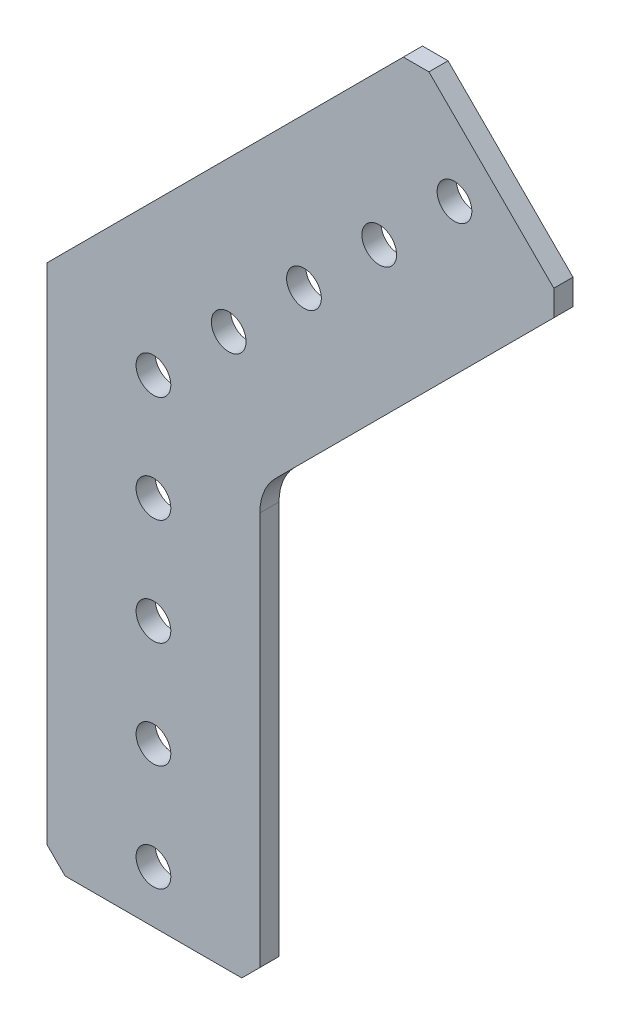
ISO-10303-21;
HEADER;
FILE_DESCRIPTION(('STEP AP214'),'2;1');
FILE_NAME('part.step','',(''),(''),'','','');
FILE_SCHEMA(('AUTOMOTIVE_DESIGN { 1 0 10303 214 1 1 1 1 }'));
ENDSEC;
DATA;
#1=APPLICATION_CONTEXT('core data for automotive mechanical design processes');
#2=APPLICATION_PROTOCOL_DEFINITION('international standard','automotive_design',2000,#1);
#3=PRODUCT_CONTEXT('',#1,'mechanical');
#4=PRODUCT('Part','Part','',(#3));
#5=PRODUCT_RELATED_PRODUCT_CATEGORY('part','',(#4));
#6=PRODUCT_DEFINITION_FORMATION('','',#4);
#7=PRODUCT_DEFINITION_CONTEXT('part definition',#1,'design');
#8=PRODUCT_DEFINITION('design','',#6,#7);
#9=PRODUCT_DEFINITION_SHAPE('','',#8);
#10=(LENGTH_UNIT() NAMED_UNIT(*) SI_UNIT(.MILLI.,.METRE.));
#11=(NAMED_UNIT(*) PLANE_ANGLE_UNIT() SI_UNIT($,.RADIAN.));
#12=(NAMED_UNIT(*) SI_UNIT($,.STERADIAN.) SOLID_ANGLE_UNIT());
#13=UNCERTAINTY_MEASURE_WITH_UNIT(LENGTH_MEASURE(1.E-05),#10,'distance_accuracy_value','');
#14=(GEOMETRIC_REPRESENTATION_CONTEXT(3) GLOBAL_UNCERTAINTY_ASSIGNED_CONTEXT((#13)) GLOBAL_UNIT_ASSIGNED_CONTEXT((#10,
#11,#12)) REPRESENTATION_CONTEXT('',''));
#15=CARTESIAN_POINT('',(0.,0.,0.));
#16=DIRECTION('',(0.,0.,1.));
#17=DIRECTION('',(1.,0.,0.));
#18=AXIS2_PLACEMENT_3D('',#15,#16,#17);
#19=CARTESIAN_POINT('',(0.,0.,2.286));
#20=DIRECTION('',(0.,0.,1.));
#21=DIRECTION('',(1.,0.,0.));
#22=AXIS2_PLACEMENT_3D('',#19,#20,#21);
#23=PLANE('',#22);
#24=CARTESIAN_POINT('',(35.9210244842766,35.9210244842766,2.286));
#25=DIRECTION('',(0.,0.,-1.));
#26=DIRECTION('',(-1.,0.,0.));
#27=AXIS2_PLACEMENT_3D('',#24,#25,#26);
#28=CIRCLE('',#27,2.0701);
#29=CARTESIAN_POINT('',(33.8509244842766,35.9210244842766,2.286));
#30=VERTEX_POINT('',#29);
#31=EDGE_CURVE('E204',#30,#30,#28,.T.);
#32=ORIENTED_EDGE('',*,*,#31,.T.);
#33=EDGE_LOOP('',(#32));
#34=FACE_BOUND('',#33,.T.);
#35=CARTESIAN_POINT('',(17.9605122421385,17.9605122421381,2.286));
#36=DIRECTION('',(0.,0.,-1.));
#37=DIRECTION('',(-1.,0.,0.));
#38=AXIS2_PLACEMENT_3D('',#35,#36,#37);
#39=CIRCLE('',#38,2.0701);
#40=CARTESIAN_POINT('',(15.8904122421385,17.9605122421381,2.286));
#41=VERTEX_POINT('',#40);
#42=EDGE_CURVE('E207',#41,#41,#39,.T.);
#43=ORIENTED_EDGE('',*,*,#42,.T.);
#44=EDGE_LOOP('',(#43));
#45=FACE_BOUND('',#44,.T.);
#46=CARTESIAN_POINT('',(8.98025612106925,8.98025612106906,2.286));
#47=DIRECTION('',(0.,0.,-1.));
#48=DIRECTION('',(-1.,0.,0.));
#49=AXIS2_PLACEMENT_3D('',#46,#47,#48);
#50=CIRCLE('',#49,2.0701);
#51=CARTESIAN_POINT('',(6.91015612106925,8.98025612106906,2.286));
#52=VERTEX_POINT('',#51);
#53=EDGE_CURVE('E210',#52,#52,#50,.T.);
#54=ORIENTED_EDGE('',*,*,#53,.T.);
#55=EDGE_LOOP('',(#54));
#56=FACE_BOUND('',#55,.T.);
#57=CARTESIAN_POINT('',(26.9407683632077,26.9407683632072,2.286));
#58=DIRECTION('',(0.,0.,-1.));
#59=DIRECTION('',(-1.,0.,0.));
#60=AXIS2_PLACEMENT_3D('',#57,#58,#59);
#61=CIRCLE('',#60,2.0701);
#62=CARTESIAN_POINT('',(24.8706683632077,26.9407683632072,2.286));
#63=VERTEX_POINT('',#62);
#64=EDGE_CURVE('E213',#63,#63,#61,.T.);
#65=ORIENTED_EDGE('',*,*,#64,.T.);
#66=EDGE_LOOP('',(#65));
#67=FACE_BOUND('',#66,.T.);
#68=CARTESIAN_POINT('',(0.,-50.8,2.286));
#69=DIRECTION('',(0.,0.,-1.));
#70=DIRECTION('',(-1.,0.,0.));
#71=AXIS2_PLACEMENT_3D('',#68,#69,#70);
#72=CIRCLE('',#71,2.0701);
#73=CARTESIAN_POINT('',(-2.07009999999999,-50.8,2.286));
#74=VERTEX_POINT('',#73);
#75=EDGE_CURVE('E216',#74,#74,#72,.T.);
#76=ORIENTED_EDGE('',*,*,#75,.T.);
#77=EDGE_LOOP('',(#76));
#78=FACE_BOUND('',#77,.T.);
#79=CARTESIAN_POINT('',(2.66050878019847E-13,-25.4,2.286));
#80=DIRECTION('',(0.,0.,-1.));
#81=DIRECTION('',(-1.,0.,0.));
#82=AXIS2_PLACEMENT_3D('',#79,#80,#81);
#83=CIRCLE('',#82,2.0701);
#84=CARTESIAN_POINT('',(-2.07009999999973,-25.4,2.286));
#85=VERTEX_POINT('',#84);
#86=EDGE_CURVE('E171',#85,#85,#83,.T.);
#87=ORIENTED_EDGE('',*,*,#86,.T.);
#88=EDGE_LOOP('',(#87));
#89=FACE_BOUND('',#88,.T.);
#90=DIRECTION('',(1.,0.,0.));
#91=VECTOR('',#90,1.);
#92=CARTESIAN_POINT('',(29.8144503219496,47.7749625640879,2.286));
#93=LINE('',#92,#91);
#94=CARTESIAN_POINT('',(32.8677374031131,47.7749625640879,2.286));
#95=VERTEX_POINT('',#94);
#96=CARTESIAN_POINT('',(29.8144503219496,47.7749625640879,2.286));
#97=VERTEX_POINT('',#96);
#98=EDGE_CURVE('E525',#95,#97,#93,.F.);
#99=ORIENTED_EDGE('',*,*,#98,.T.);
#100=DIRECTION('',(0.707106781186547,0.707106781186548,0.));
#101=VECTOR('',#100,1.);
#102=CARTESIAN_POINT('',(31.3410938625313,49.3016061046697,2.286));
#103=LINE('',#102,#101);
#104=CARTESIAN_POINT('',(-12.7,5.26051224213831,2.286));
#105=VERTEX_POINT('',#104);
#106=EDGE_CURVE('E520',#97,#105,#103,.F.);
#107=ORIENTED_EDGE('',*,*,#106,.T.);
#108=DIRECTION('',(0.,1.,0.));
#109=VECTOR('',#108,1.);
#110=CARTESIAN_POINT('',(-12.7,-57.023,2.286));
#111=LINE('',#110,#109);
#112=CARTESIAN_POINT('',(-12.7,-54.864,2.286));
#113=VERTEX_POINT('',#112);
#114=EDGE_CURVE('E517',#105,#113,#111,.F.);
#115=ORIENTED_EDGE('',*,*,#114,.T.);
#116=DIRECTION('',(-0.707106781186548,0.707106781186548,0.));
#117=VECTOR('',#116,1.);
#118=CARTESIAN_POINT('',(-10.541,-57.023,2.286));
#119=LINE('',#118,#117);
#120=CARTESIAN_POINT('',(-10.541,-57.023,2.286));
#121=VERTEX_POINT('',#120);
#122=EDGE_CURVE('E155',#113,#121,#119,.F.);
#123=ORIENTED_EDGE('',*,*,#122,.T.);
#124=DIRECTION('',(1.,0.,0.));
#125=VECTOR('',#124,1.);
#126=CARTESIAN_POINT('',(12.7,-57.023,2.286));
#127=LINE('',#126,#125);
#128=CARTESIAN_POINT('',(10.541,-57.023,2.286));
#129=VERTEX_POINT('',#128);
#130=EDGE_CURVE('E168',#121,#129,#127,.T.);
#131=ORIENTED_EDGE('',*,*,#130,.T.);
#132=DIRECTION('',(-0.707106781186547,-0.707106781186548,0.));
#133=VECTOR('',#132,1.);
#134=CARTESIAN_POINT('',(12.7,-54.864,2.286));
#135=LINE('',#134,#133);
#136=CARTESIAN_POINT('',(12.7,-54.864,2.286));
#137=VERTEX_POINT('',#136);
#138=EDGE_CURVE('E142',#129,#137,#135,.F.);
#139=ORIENTED_EDGE('',*,*,#138,.T.);
#140=DIRECTION('',(0.,-1.,0.));
#141=VECTOR('',#140,1.);
#142=CARTESIAN_POINT('',(12.7,-5.2605122421383,2.286));
#143=LINE('',#142,#141);
#144=CARTESIAN_POINT('',(12.7,-7.89076836320745,2.286));
#145=VERTEX_POINT('',#144);
#146=EDGE_CURVE('E98',#137,#145,#143,.F.);
#147=ORIENTED_EDGE('',*,*,#146,.T.);
#148=CARTESIAN_POINT('',(19.05,-7.89076836320745,2.286));
#149=DIRECTION('',(0.,0.,1.));
#150=DIRECTION('',(1.,0.,0.));
#151=AXIS2_PLACEMENT_3D('',#148,#149,#150);
#152=CIRCLE('',#151,6.35);
#153=CARTESIAN_POINT('',(14.5598719394654,-3.40064030267288,2.286));
#154=VERTEX_POINT('',#153);
#155=EDGE_CURVE('E100',#145,#154,#152,.F.);
#156=ORIENTED_EDGE('',*,*,#155,.T.);
#157=DIRECTION('',(-0.707106781186547,-0.707106781186548,0.));
#158=VECTOR('',#157,1.);
#159=CARTESIAN_POINT('',(12.7,-5.26051224213831,2.286));
#160=LINE('',#159,#158);
#161=CARTESIAN_POINT('',(47.7749625640879,29.8144503219496,2.286));
#162=VERTEX_POINT('',#161);
#163=EDGE_CURVE('E103',#154,#162,#160,.F.);
#164=ORIENTED_EDGE('',*,*,#163,.T.);
#165=DIRECTION('',(0.,-1.,0.));
#166=VECTOR('',#165,1.);
#167=CARTESIAN_POINT('',(47.7749625640879,32.8677374031131,2.286));
#168=LINE('',#167,#166);
#169=CARTESIAN_POINT('',(47.7749625640879,32.8677374031131,2.286));
#170=VERTEX_POINT('',#169);
#171=EDGE_CURVE('E135',#162,#170,#168,.F.);
#172=ORIENTED_EDGE('',*,*,#171,.T.);
#173=DIRECTION('',(0.707106781186548,-0.707106781186547,0.));
#174=VECTOR('',#173,1.);
#175=CARTESIAN_POINT('',(49.3016061046696,31.3410938625314,2.286));
#176=LINE('',#175,#174);
#177=EDGE_CURVE('E529',#170,#95,#176,.F.);
#178=ORIENTED_EDGE('',*,*,#177,.T.);
#179=EDGE_LOOP('',(#99,#107,#115,#123,#131,#139,#147,#156,#164,#172,#178));
#180=FACE_BOUND('',#179,.T.);
#181=CARTESIAN_POINT('',(1.33025439009923E-13,-12.7,2.286));
#182=DIRECTION('',(0.,0.,-1.));
#183=DIRECTION('',(-1.,0.,0.));
#184=AXIS2_PLACEMENT_3D('',#181,#182,#183);
#185=CIRCLE('',#184,2.0701);
#186=CARTESIAN_POINT('',(-2.07009999999987,-12.7,2.286));
#187=VERTEX_POINT('',#186);
#188=EDGE_CURVE('E165',#187,#187,#185,.T.);
#189=ORIENTED_EDGE('',*,*,#188,.T.);
#190=EDGE_LOOP('',(#189));
#191=FACE_BOUND('',#190,.T.);
#192=CARTESIAN_POINT('',(3.9907631702977E-13,-38.1,2.286));
#193=DIRECTION('',(0.,0.,-1.));
#194=DIRECTION('',(-1.,0.,0.));
#195=AXIS2_PLACEMENT_3D('',#192,#193,#194);
#196=CIRCLE('',#195,2.0701);
#197=CARTESIAN_POINT('',(-2.0700999999996,-38.1,2.286));
#198=VERTEX_POINT('',#197);
#199=EDGE_CURVE('E222',#198,#198,#196,.T.);
#200=ORIENTED_EDGE('',*,*,#199,.T.);
#201=EDGE_LOOP('',(#200));
#202=FACE_BOUND('',#201,.T.);
#203=CARTESIAN_POINT('',(0.,0.,2.286));
#204=DIRECTION('',(0.,0.,-1.));
#205=DIRECTION('',(-1.,0.,0.));
#206=AXIS2_PLACEMENT_3D('',#203,#204,#205);
#207=CIRCLE('',#206,2.0701);
#208=CARTESIAN_POINT('',(-2.0701,0.,2.286));
#209=VERTEX_POINT('',#208);
#210=EDGE_CURVE('E20',#209,#209,#207,.T.);
#211=ORIENTED_EDGE('',*,*,#210,.T.);
#212=EDGE_LOOP('',(#211));
#213=FACE_BOUND('',#212,.T.);
#214=ADVANCED_FACE('F17',(#34,#45,#56,#67,#78,#89,#180,#191,#202,#213),#23,.T.);
#215=CARTESIAN_POINT('',(0.,0.,2.286));
#216=DIRECTION('',(0.,0.,-1.));
#217=DIRECTION('',(-1.,0.,0.));
#218=AXIS2_PLACEMENT_3D('',#215,#216,#217);
#219=CYLINDRICAL_SURFACE('',#218,2.0701);
#220=ORIENTED_EDGE('',*,*,#210,.F.);
#221=EDGE_LOOP('',(#220));
#222=FACE_BOUND('',#221,.T.);
#223=CARTESIAN_POINT('',(0.,0.,0.));
#224=DIRECTION('',(0.,0.,-1.));
#225=DIRECTION('',(-1.,0.,0.));
#226=AXIS2_PLACEMENT_3D('',#223,#224,#225);
#227=CIRCLE('',#226,2.0701);
#228=CARTESIAN_POINT('',(-2.0701,0.,0.));
#229=VERTEX_POINT('',#228);
#230=EDGE_CURVE('E201',#229,#229,#227,.T.);
#231=ORIENTED_EDGE('',*,*,#230,.T.);
#232=EDGE_LOOP('',(#231));
#233=FACE_BOUND('',#232,.T.);
#234=ADVANCED_FACE('F230',(#222,#233),#219,.F.);
#235=CARTESIAN_POINT('',(3.9907631702977E-13,-38.1,2.286));
#236=DIRECTION('',(0.,0.,-1.));
#237=DIRECTION('',(-1.,0.,0.));
#238=AXIS2_PLACEMENT_3D('',#235,#236,#237);
#239=CYLINDRICAL_SURFACE('',#238,2.0701);
#240=CARTESIAN_POINT('',(3.9907631702977E-13,-38.1,0.));
#241=DIRECTION('',(0.,0.,-1.));
#242=DIRECTION('',(-1.,0.,0.));
#243=AXIS2_PLACEMENT_3D('',#240,#241,#242);
#244=CIRCLE('',#243,2.0701);
#245=CARTESIAN_POINT('',(-2.0700999999996,-38.1,0.));
#246=VERTEX_POINT('',#245);
#247=EDGE_CURVE('E198',#246,#246,#244,.T.);
#248=ORIENTED_EDGE('',*,*,#247,.T.);
#249=EDGE_LOOP('',(#248));
#250=FACE_BOUND('',#249,.T.);
#251=ORIENTED_EDGE('',*,*,#199,.F.);
#252=EDGE_LOOP('',(#251));
#253=FACE_BOUND('',#252,.T.);
#254=ADVANCED_FACE('F233',(#250,#253),#239,.F.);
#255=CARTESIAN_POINT('',(1.33025439009923E-13,-12.7,2.286));
#256=DIRECTION('',(0.,0.,-1.));
#257=DIRECTION('',(-1.,0.,0.));
#258=AXIS2_PLACEMENT_3D('',#255,#256,#257);
#259=CYLINDRICAL_SURFACE('',#258,2.0701);
#260=CARTESIAN_POINT('',(1.33025439009923E-13,-12.7,0.));
#261=DIRECTION('',(0.,0.,-1.));
#262=DIRECTION('',(-1.,0.,0.));
#263=AXIS2_PLACEMENT_3D('',#260,#261,#262);
#264=CIRCLE('',#263,2.0701);
#265=CARTESIAN_POINT('',(-2.07009999999987,-12.7,0.));
#266=VERTEX_POINT('',#265);
#267=EDGE_CURVE('E149',#266,#266,#264,.T.);
#268=ORIENTED_EDGE('',*,*,#267,.T.);
#269=EDGE_LOOP('',(#268));
#270=FACE_BOUND('',#269,.T.);
#271=ORIENTED_EDGE('',*,*,#188,.F.);
#272=EDGE_LOOP('',(#271));
#273=FACE_BOUND('',#272,.T.);
#274=ADVANCED_FACE('F308',(#270,#273),#259,.F.);
#275=CARTESIAN_POINT('',(12.7,-54.864,2.286));
#276=DIRECTION('',(-0.707106781186548,0.707106781186547,0.));
#277=DIRECTION('',(-0.707106781186547,-0.707106781186548,0.));
#278=AXIS2_PLACEMENT_3D('',#275,#276,#277);
#279=PLANE('',#278);
#280=DIRECTION('',(0.,0.,1.));
#281=VECTOR('',#280,1.);
#282=CARTESIAN_POINT('',(10.541,-57.023,2.286));
#283=LINE('',#282,#281);
#284=CARTESIAN_POINT('',(10.541,-57.023,0.));
#285=VERTEX_POINT('',#284);
#286=EDGE_CURVE('E152',#129,#285,#283,.F.);
#287=ORIENTED_EDGE('',*,*,#286,.T.);
#288=DIRECTION('',(0.707106781186548,0.707106781186547,0.));
#289=VECTOR('',#288,1.);
#290=CARTESIAN_POINT('',(10.541,-57.023,0.));
#291=LINE('',#290,#289);
#292=CARTESIAN_POINT('',(12.7,-54.864,0.));
#293=VERTEX_POINT('',#292);
#294=EDGE_CURVE('E145',#285,#293,#291,.T.);
#295=ORIENTED_EDGE('',*,*,#294,.T.);
#296=DIRECTION('',(0.,0.,1.));
#297=VECTOR('',#296,1.);
#298=CARTESIAN_POINT('',(12.7,-54.864,2.286));
#299=LINE('',#298,#297);
#300=EDGE_CURVE('E139',#293,#137,#299,.T.);
#301=ORIENTED_EDGE('',*,*,#300,.T.);
#302=ORIENTED_EDGE('',*,*,#138,.F.);
#303=EDGE_LOOP('',(#287,#295,#301,#302));
#304=FACE_BOUND('',#303,.T.);
#305=ADVANCED_FACE('F304',(#304),#279,.F.);
#306=CARTESIAN_POINT('',(12.7,-5.2605122421383,2.286));
#307=DIRECTION('',(-1.,0.,0.));
#308=DIRECTION('',(0.,-1.,0.));
#309=AXIS2_PLACEMENT_3D('',#306,#307,#308);
#310=PLANE('',#309);
#311=DIRECTION('',(0.,0.,1.));
#312=VECTOR('',#311,1.);
#313=CARTESIAN_POINT('',(12.7,-7.89076836320745,2.286));
#314=LINE('',#313,#312);
#315=CARTESIAN_POINT('',(12.7,-7.89076836320745,0.));
#316=VERTEX_POINT('',#315);
#317=EDGE_CURVE('E109',#316,#145,#314,.T.);
#318=ORIENTED_EDGE('',*,*,#317,.T.);
#319=ORIENTED_EDGE('',*,*,#146,.F.);
#320=ORIENTED_EDGE('',*,*,#300,.F.);
#321=DIRECTION('',(0.,1.,0.));
#322=VECTOR('',#321,1.);
#323=CARTESIAN_POINT('',(12.7,0.,0.));
#324=LINE('',#323,#322);
#325=EDGE_CURVE('E148',#293,#316,#324,.T.);
#326=ORIENTED_EDGE('',*,*,#325,.T.);
#327=EDGE_LOOP('',(#318,#319,#320,#326));
#328=FACE_BOUND('',#327,.T.);
#329=ADVANCED_FACE('F301',(#328),#310,.F.);
#330=CARTESIAN_POINT('',(19.05,-7.89076836320745,2.286));
#331=DIRECTION('',(0.,0.,1.));
#332=DIRECTION('',(1.,0.,0.));
#333=AXIS2_PLACEMENT_3D('',#330,#331,#332);
#334=CYLINDRICAL_SURFACE('',#333,6.35);
#335=ORIENTED_EDGE('',*,*,#317,.F.);
#336=CARTESIAN_POINT('',(19.05,-7.89076836320745,0.));
#337=DIRECTION('',(0.,0.,1.));
#338=DIRECTION('',(1.,0.,0.));
#339=AXIS2_PLACEMENT_3D('',#336,#337,#338);
#340=CIRCLE('',#339,6.35);
#341=CARTESIAN_POINT('',(14.5598719394654,-3.40064030267288,0.));
#342=VERTEX_POINT('',#341);
#343=EDGE_CURVE('E121',#316,#342,#340,.F.);
#344=ORIENTED_EDGE('',*,*,#343,.T.);
#345=DIRECTION('',(0.,0.,1.));
#346=VECTOR('',#345,1.);
#347=CARTESIAN_POINT('',(14.5598719394654,-3.40064030267288,2.286));
#348=LINE('',#347,#346);
#349=EDGE_CURVE('E108',#342,#154,#348,.T.);
#350=ORIENTED_EDGE('',*,*,#349,.T.);
#351=ORIENTED_EDGE('',*,*,#155,.F.);
#352=EDGE_LOOP('',(#335,#344,#350,#351));
#353=FACE_BOUND('',#352,.T.);
#354=ADVANCED_FACE('F119',(#353),#334,.F.);
#355=CARTESIAN_POINT('',(12.7,-5.26051224213831,2.286));
#356=DIRECTION('',(-0.707106781186548,0.707106781186547,0.));
#357=DIRECTION('',(-0.707106781186547,-0.707106781186548,0.));
#358=AXIS2_PLACEMENT_3D('',#355,#356,#357);
#359=PLANE('',#358);
#360=ORIENTED_EDGE('',*,*,#349,.F.);
#361=DIRECTION('',(0.707106781186547,0.707106781186548,0.));
#362=VECTOR('',#361,1.);
#363=CARTESIAN_POINT('',(14.5598719394654,-3.40064030267288,0.));
#364=LINE('',#363,#362);
#365=CARTESIAN_POINT('',(47.7749625640879,29.8144503219496,0.));
#366=VERTEX_POINT('',#365);
#367=EDGE_CURVE('E131',#342,#366,#364,.T.);
#368=ORIENTED_EDGE('',*,*,#367,.T.);
#369=DIRECTION('',(0.,0.,1.));
#370=VECTOR('',#369,1.);
#371=CARTESIAN_POINT('',(47.7749625640879,29.8144503219496,2.286));
#372=LINE('',#371,#370);
#373=EDGE_CURVE('E116',#366,#162,#372,.T.);
#374=ORIENTED_EDGE('',*,*,#373,.T.);
#375=ORIENTED_EDGE('',*,*,#163,.F.);
#376=EDGE_LOOP('',(#360,#368,#374,#375));
#377=FACE_BOUND('',#376,.T.);
#378=ADVANCED_FACE('F113',(#377),#359,.F.);
#379=CARTESIAN_POINT('',(47.7749625640879,32.8677374031131,2.286));
#380=DIRECTION('',(-1.,0.,0.));
#381=DIRECTION('',(0.,-1.,0.));
#382=AXIS2_PLACEMENT_3D('',#379,#380,#381);
#383=PLANE('',#382);
#384=ORIENTED_EDGE('',*,*,#373,.F.);
#385=DIRECTION('',(0.,1.,0.));
#386=VECTOR('',#385,1.);
#387=CARTESIAN_POINT('',(47.7749625640879,0.,0.));
#388=LINE('',#387,#386);
#389=CARTESIAN_POINT('',(47.7749625640879,32.8677374031131,0.));
#390=VERTEX_POINT('',#389);
#391=EDGE_CURVE('E127',#366,#390,#388,.T.);
#392=ORIENTED_EDGE('',*,*,#391,.T.);
#393=DIRECTION('',(0.,0.,1.));
#394=VECTOR('',#393,1.);
#395=CARTESIAN_POINT('',(47.7749625640879,32.8677374031131,2.286));
#396=LINE('',#395,#394);
#397=EDGE_CURVE('E125',#390,#170,#396,.T.);
#398=ORIENTED_EDGE('',*,*,#397,.T.);
#399=ORIENTED_EDGE('',*,*,#171,.F.);
#400=EDGE_LOOP('',(#384,#392,#398,#399));
#401=FACE_BOUND('',#400,.T.);
#402=ADVANCED_FACE('F292',(#401),#383,.F.);
#403=CARTESIAN_POINT('',(49.3016061046696,31.3410938625314,2.286));
#404=DIRECTION('',(-0.707106781186547,-0.707106781186548,0.));
#405=DIRECTION('',(0.707106781186548,-0.707106781186547,0.));
#406=AXIS2_PLACEMENT_3D('',#403,#404,#405);
#407=PLANE('',#406);
#408=DIRECTION('',(0.,0.,-1.));
#409=VECTOR('',#408,1.);
#410=CARTESIAN_POINT('',(32.8677374031131,47.7749625640879,2.286));
#411=LINE('',#410,#409);
#412=CARTESIAN_POINT('',(32.8677374031131,47.7749625640879,0.));
#413=VERTEX_POINT('',#412);
#414=EDGE_CURVE('E527',#413,#95,#411,.F.);
#415=ORIENTED_EDGE('',*,*,#414,.T.);
#416=ORIENTED_EDGE('',*,*,#177,.F.);
#417=ORIENTED_EDGE('',*,*,#397,.F.);
#418=DIRECTION('',(-0.707106781186547,0.707106781186547,0.));
#419=VECTOR('',#418,1.);
#420=CARTESIAN_POINT('',(47.7749625640879,32.8677374031131,0.));
#421=LINE('',#420,#419);
#422=EDGE_CURVE('E130',#390,#413,#421,.T.);
#423=ORIENTED_EDGE('',*,*,#422,.T.);
#424=EDGE_LOOP('',(#415,#416,#417,#423));
#425=FACE_BOUND('',#424,.T.);
#426=ADVANCED_FACE('F288',(#425),#407,.F.);
#427=CARTESIAN_POINT('',(29.8144503219496,47.7749625640879,2.286));
#428=DIRECTION('',(0.,-1.,0.));
#429=DIRECTION('',(0.,0.,-1.));
#430=AXIS2_PLACEMENT_3D('',#427,#428,#429);
#431=PLANE('',#430);
#432=ORIENTED_EDGE('',*,*,#414,.F.);
#433=DIRECTION('',(1.,0.,0.));
#434=VECTOR('',#433,1.);
#435=CARTESIAN_POINT('',(0.,47.7749625640879,0.));
#436=LINE('',#435,#434);
#437=CARTESIAN_POINT('',(29.8144503219496,47.7749625640879,0.));
#438=VERTEX_POINT('',#437);
#439=EDGE_CURVE('E500',#413,#438,#436,.F.);
#440=ORIENTED_EDGE('',*,*,#439,.T.);
#441=DIRECTION('',(0.,0.,1.));
#442=VECTOR('',#441,1.);
#443=CARTESIAN_POINT('',(29.8144503219496,47.7749625640879,2.286));
#444=LINE('',#443,#442);
#445=EDGE_CURVE('E522',#438,#97,#444,.T.);
#446=ORIENTED_EDGE('',*,*,#445,.T.);
#447=ORIENTED_EDGE('',*,*,#98,.F.);
#448=EDGE_LOOP('',(#432,#440,#446,#447));
#449=FACE_BOUND('',#448,.T.);
#450=ADVANCED_FACE('F284',(#449),#431,.F.);
#451=CARTESIAN_POINT('',(31.3410938625313,49.3016061046697,2.286));
#452=DIRECTION('',(0.707106781186548,-0.707106781186547,0.));
#453=DIRECTION('',(0.707106781186547,0.707106781186548,0.));
#454=AXIS2_PLACEMENT_3D('',#451,#452,#453);
#455=PLANE('',#454);
#456=ORIENTED_EDGE('',*,*,#445,.F.);
#457=DIRECTION('',(-0.707106781186547,-0.707106781186548,0.));
#458=VECTOR('',#457,1.);
#459=CARTESIAN_POINT('',(29.8144503219496,47.7749625640879,0.));
#460=LINE('',#459,#458);
#461=CARTESIAN_POINT('',(-12.7,5.26051224213831,0.));
#462=VERTEX_POINT('',#461);
#463=EDGE_CURVE('E498',#438,#462,#460,.T.);
#464=ORIENTED_EDGE('',*,*,#463,.T.);
#465=DIRECTION('',(0.,0.,1.));
#466=VECTOR('',#465,1.);
#467=CARTESIAN_POINT('',(-12.7,5.2605122421383,2.286));
#468=LINE('',#467,#466);
#469=EDGE_CURVE('E497',#462,#105,#468,.T.);
#470=ORIENTED_EDGE('',*,*,#469,.T.);
#471=ORIENTED_EDGE('',*,*,#106,.F.);
#472=EDGE_LOOP('',(#456,#464,#470,#471));
#473=FACE_BOUND('',#472,.T.);
#474=ADVANCED_FACE('F280',(#473),#455,.F.);
#475=CARTESIAN_POINT('',(-12.7,-57.023,2.286));
#476=DIRECTION('',(1.,0.,0.));
#477=DIRECTION('',(0.,1.,0.));
#478=AXIS2_PLACEMENT_3D('',#475,#476,#477);
#479=PLANE('',#478);
#480=DIRECTION('',(0.,0.,1.));
#481=VECTOR('',#480,1.);
#482=CARTESIAN_POINT('',(-12.7,-54.864,2.286));
#483=LINE('',#482,#481);
#484=CARTESIAN_POINT('',(-12.7,-54.864,0.));
#485=VERTEX_POINT('',#484);
#486=EDGE_CURVE('E495',#485,#113,#483,.T.);
#487=ORIENTED_EDGE('',*,*,#486,.T.);
#488=ORIENTED_EDGE('',*,*,#114,.F.);
#489=ORIENTED_EDGE('',*,*,#469,.F.);
#490=DIRECTION('',(0.,1.,0.));
#491=VECTOR('',#490,1.);
#492=CARTESIAN_POINT('',(-12.7,0.,0.));
#493=LINE('',#492,#491);
#494=EDGE_CURVE('E490',#462,#485,#493,.F.);
#495=ORIENTED_EDGE('',*,*,#494,.T.);
#496=EDGE_LOOP('',(#487,#488,#489,#495));
#497=FACE_BOUND('',#496,.T.);
#498=ADVANCED_FACE('F276',(#497),#479,.F.);
#499=CARTESIAN_POINT('',(-10.541,-57.023,2.286));
#500=DIRECTION('',(0.707106781186548,0.707106781186548,0.));
#501=DIRECTION('',(-0.707106781186548,0.707106781186548,0.));
#502=AXIS2_PLACEMENT_3D('',#499,#500,#501);
#503=PLANE('',#502);
#504=ORIENTED_EDGE('',*,*,#486,.F.);
#505=DIRECTION('',(0.707106781186547,-0.707106781186548,0.));
#506=VECTOR('',#505,1.);
#507=CARTESIAN_POINT('',(-12.7,-54.864,0.));
#508=LINE('',#507,#506);
#509=CARTESIAN_POINT('',(-10.541,-57.023,0.));
#510=VERTEX_POINT('',#509);
#511=EDGE_CURVE('E161',#485,#510,#508,.T.);
#512=ORIENTED_EDGE('',*,*,#511,.T.);
#513=DIRECTION('',(0.,0.,1.));
#514=VECTOR('',#513,1.);
#515=CARTESIAN_POINT('',(-10.541,-57.023,2.286));
#516=LINE('',#515,#514);
#517=EDGE_CURVE('E35',#510,#121,#516,.T.);
#518=ORIENTED_EDGE('',*,*,#517,.T.);
#519=ORIENTED_EDGE('',*,*,#122,.F.);
#520=EDGE_LOOP('',(#504,#512,#518,#519));
#521=FACE_BOUND('',#520,.T.);
#522=ADVANCED_FACE('F273',(#521),#503,.F.);
#523=CARTESIAN_POINT('',(12.7,-57.023,2.286));
#524=DIRECTION('',(0.,1.,0.));
#525=DIRECTION('',(0.,0.,1.));
#526=AXIS2_PLACEMENT_3D('',#523,#524,#525);
#527=PLANE('',#526);
#528=ORIENTED_EDGE('',*,*,#517,.F.);
#529=DIRECTION('',(1.,0.,0.));
#530=VECTOR('',#529,1.);
#531=CARTESIAN_POINT('',(0.,-57.023,0.));
#532=LINE('',#531,#530);
#533=EDGE_CURVE('E158',#510,#285,#532,.T.);
#534=ORIENTED_EDGE('',*,*,#533,.T.);
#535=ORIENTED_EDGE('',*,*,#286,.F.);
#536=ORIENTED_EDGE('',*,*,#130,.F.);
#537=EDGE_LOOP('',(#528,#534,#535,#536));
#538=FACE_BOUND('',#537,.T.);
#539=ADVANCED_FACE('F269',(#538),#527,.F.);
#540=CARTESIAN_POINT('',(2.66050878019847E-13,-25.4,2.286));
#541=DIRECTION('',(0.,0.,-1.));
#542=DIRECTION('',(-1.,0.,0.));
#543=AXIS2_PLACEMENT_3D('',#540,#541,#542);
#544=CYLINDRICAL_SURFACE('',#543,2.0701);
#545=CARTESIAN_POINT('',(2.66050878019847E-13,-25.4,0.));
#546=DIRECTION('',(0.,0.,-1.));
#547=DIRECTION('',(-1.,0.,0.));
#548=AXIS2_PLACEMENT_3D('',#545,#546,#547);
#549=CIRCLE('',#548,2.0701);
#550=CARTESIAN_POINT('',(-2.07009999999973,-25.4,0.));
#551=VERTEX_POINT('',#550);
#552=EDGE_CURVE('E160',#551,#551,#549,.T.);
#553=ORIENTED_EDGE('',*,*,#552,.T.);
#554=EDGE_LOOP('',(#553));
#555=FACE_BOUND('',#554,.T.);
#556=ORIENTED_EDGE('',*,*,#86,.F.);
#557=EDGE_LOOP('',(#556));
#558=FACE_BOUND('',#557,.T.);
#559=ADVANCED_FACE('F265',(#555,#558),#544,.F.);
#560=CARTESIAN_POINT('',(0.,-50.8,2.286));
#561=DIRECTION('',(0.,0.,-1.));
#562=DIRECTION('',(-1.,0.,0.));
#563=AXIS2_PLACEMENT_3D('',#560,#561,#562);
#564=CYLINDRICAL_SURFACE('',#563,2.0701);
#565=CARTESIAN_POINT('',(0.,-50.8,0.));
#566=DIRECTION('',(0.,0.,-1.));
#567=DIRECTION('',(-1.,0.,0.));
#568=AXIS2_PLACEMENT_3D('',#565,#566,#567);
#569=CIRCLE('',#568,2.0701);
#570=CARTESIAN_POINT('',(-2.07009999999999,-50.8,0.));
#571=VERTEX_POINT('',#570);
#572=EDGE_CURVE('E190',#571,#571,#569,.T.);
#573=ORIENTED_EDGE('',*,*,#572,.T.);
#574=EDGE_LOOP('',(#573));
#575=FACE_BOUND('',#574,.T.);
#576=ORIENTED_EDGE('',*,*,#75,.F.);
#577=EDGE_LOOP('',(#576));
#578=FACE_BOUND('',#577,.T.);
#579=ADVANCED_FACE('F261',(#575,#578),#564,.F.);
#580=CARTESIAN_POINT('',(26.9407683632077,26.9407683632072,2.286));
#581=DIRECTION('',(0.,0.,-1.));
#582=DIRECTION('',(-1.,0.,0.));
#583=AXIS2_PLACEMENT_3D('',#580,#581,#582);
#584=CYLINDRICAL_SURFACE('',#583,2.0701);
#585=ORIENTED_EDGE('',*,*,#64,.F.);
#586=EDGE_LOOP('',(#585));
#587=FACE_BOUND('',#586,.T.);
#588=CARTESIAN_POINT('',(26.9407683632077,26.9407683632072,0.));
#589=DIRECTION('',(0.,0.,-1.));
#590=DIRECTION('',(-1.,0.,0.));
#591=AXIS2_PLACEMENT_3D('',#588,#589,#590);
#592=CIRCLE('',#591,2.0701);
#593=CARTESIAN_POINT('',(24.8706683632077,26.9407683632072,0.));
#594=VERTEX_POINT('',#593);
#595=EDGE_CURVE('E187',#594,#594,#592,.T.);
#596=ORIENTED_EDGE('',*,*,#595,.T.);
#597=EDGE_LOOP('',(#596));
#598=FACE_BOUND('',#597,.T.);
#599=ADVANCED_FACE('F257',(#587,#598),#584,.F.);
#600=CARTESIAN_POINT('',(8.98025612106925,8.98025612106906,2.286));
#601=DIRECTION('',(0.,0.,-1.));
#602=DIRECTION('',(-1.,0.,0.));
#603=AXIS2_PLACEMENT_3D('',#600,#601,#602);
#604=CYLINDRICAL_SURFACE('',#603,2.0701);
#605=ORIENTED_EDGE('',*,*,#53,.F.);
#606=EDGE_LOOP('',(#605));
#607=FACE_BOUND('',#606,.T.);
#608=CARTESIAN_POINT('',(8.98025612106925,8.98025612106906,0.));
#609=DIRECTION('',(0.,0.,-1.));
#610=DIRECTION('',(-1.,0.,0.));
#611=AXIS2_PLACEMENT_3D('',#608,#609,#610);
#612=CIRCLE('',#611,2.0701);
#613=CARTESIAN_POINT('',(6.91015612106925,8.98025612106906,0.));
#614=VERTEX_POINT('',#613);
#615=EDGE_CURVE('E184',#614,#614,#612,.T.);
#616=ORIENTED_EDGE('',*,*,#615,.T.);
#617=EDGE_LOOP('',(#616));
#618=FACE_BOUND('',#617,.T.);
#619=ADVANCED_FACE('F253',(#607,#618),#604,.F.);
#620=CARTESIAN_POINT('',(17.9605122421385,17.9605122421381,2.286));
#621=DIRECTION('',(0.,0.,-1.));
#622=DIRECTION('',(-1.,0.,0.));
#623=AXIS2_PLACEMENT_3D('',#620,#621,#622);
#624=CYLINDRICAL_SURFACE('',#623,2.0701);
#625=ORIENTED_EDGE('',*,*,#42,.F.);
#626=EDGE_LOOP('',(#625));
#627=FACE_BOUND('',#626,.T.);
#628=CARTESIAN_POINT('',(17.9605122421385,17.9605122421381,0.));
#629=DIRECTION('',(0.,0.,-1.));
#630=DIRECTION('',(-1.,0.,0.));
#631=AXIS2_PLACEMENT_3D('',#628,#629,#630);
#632=CIRCLE('',#631,2.0701);
#633=CARTESIAN_POINT('',(15.8904122421385,17.9605122421381,0.));
#634=VERTEX_POINT('',#633);
#635=EDGE_CURVE('E26',#634,#634,#632,.T.);
#636=ORIENTED_EDGE('',*,*,#635,.T.);
#637=EDGE_LOOP('',(#636));
#638=FACE_BOUND('',#637,.T.);
#639=ADVANCED_FACE('F245',(#627,#638),#624,.F.);
#640=CARTESIAN_POINT('',(35.9210244842766,35.9210244842766,2.286));
#641=DIRECTION('',(0.,0.,-1.));
#642=DIRECTION('',(-1.,0.,0.));
#643=AXIS2_PLACEMENT_3D('',#640,#641,#642);
#644=CYLINDRICAL_SURFACE('',#643,2.0701);
#645=ORIENTED_EDGE('',*,*,#31,.F.);
#646=EDGE_LOOP('',(#645));
#647=FACE_BOUND('',#646,.T.);
#648=CARTESIAN_POINT('',(35.9210244842766,35.9210244842766,0.));
#649=DIRECTION('',(0.,0.,-1.));
#650=DIRECTION('',(-1.,0.,0.));
#651=AXIS2_PLACEMENT_3D('',#648,#649,#650);
#652=CIRCLE('',#651,2.0701);
#653=CARTESIAN_POINT('',(33.8509244842766,35.9210244842766,0.));
#654=VERTEX_POINT('',#653);
#655=EDGE_CURVE('E10',#654,#654,#652,.T.);
#656=ORIENTED_EDGE('',*,*,#655,.T.);
#657=EDGE_LOOP('',(#656));
#658=FACE_BOUND('',#657,.T.);
#659=ADVANCED_FACE('F238',(#647,#658),#644,.F.);
#660=CARTESIAN_POINT('',(0.,0.,0.));
#661=DIRECTION('',(0.,0.,1.));
#662=DIRECTION('',(1.,0.,0.));
#663=AXIS2_PLACEMENT_3D('',#660,#661,#662);
#664=PLANE('',#663);
#665=ORIENTED_EDGE('',*,*,#655,.F.);
#666=EDGE_LOOP('',(#665));
#667=FACE_BOUND('',#666,.T.);
#668=ORIENTED_EDGE('',*,*,#635,.F.);
#669=EDGE_LOOP('',(#668));
#670=FACE_BOUND('',#669,.T.);
#671=ORIENTED_EDGE('',*,*,#615,.F.);
#672=EDGE_LOOP('',(#671));
#673=FACE_BOUND('',#672,.T.);
#674=ORIENTED_EDGE('',*,*,#595,.F.);
#675=EDGE_LOOP('',(#674));
#676=FACE_BOUND('',#675,.T.);
#677=ORIENTED_EDGE('',*,*,#572,.F.);
#678=EDGE_LOOP('',(#677));
#679=FACE_BOUND('',#678,.T.);
#680=ORIENTED_EDGE('',*,*,#552,.F.);
#681=EDGE_LOOP('',(#680));
#682=FACE_BOUND('',#681,.T.);
#683=ORIENTED_EDGE('',*,*,#511,.F.);
#684=ORIENTED_EDGE('',*,*,#494,.F.);
#685=ORIENTED_EDGE('',*,*,#463,.F.);
#686=ORIENTED_EDGE('',*,*,#439,.F.);
#687=ORIENTED_EDGE('',*,*,#422,.F.);
#688=ORIENTED_EDGE('',*,*,#391,.F.);
#689=ORIENTED_EDGE('',*,*,#367,.F.);
#690=ORIENTED_EDGE('',*,*,#343,.F.);
#691=ORIENTED_EDGE('',*,*,#325,.F.);
#692=ORIENTED_EDGE('',*,*,#294,.F.);
#693=ORIENTED_EDGE('',*,*,#533,.F.);
#694=EDGE_LOOP('',(#683,#684,#685,#686,#687,#688,#689,#690,#691,#692,#693));
#695=FACE_BOUND('',#694,.T.);
#696=ORIENTED_EDGE('',*,*,#267,.F.);
#697=EDGE_LOOP('',(#696));
#698=FACE_BOUND('',#697,.T.);
#699=ORIENTED_EDGE('',*,*,#247,.F.);
#700=EDGE_LOOP('',(#699));
#701=FACE_BOUND('',#700,.T.);
#702=ORIENTED_EDGE('',*,*,#230,.F.);
#703=EDGE_LOOP('',(#702));
#704=FACE_BOUND('',#703,.T.);
#705=ADVANCED_FACE('F236',(#667,#670,#673,#676,#679,#682,#695,#698,#701,#704),#664,.F.);
#706=CLOSED_SHELL('',(#214,#234,#254,#274,#305,#329,#354,#378,#402,#426,#450,#474,#498,#522,
#539,#559,#579,#599,#619,#639,#659,#705));
#707=MANIFOLD_SOLID_BREP('B1',#706);
#708=ADVANCED_BREP_SHAPE_REPRESENTATION('',(#18,#707),#14);
#709=SHAPE_DEFINITION_REPRESENTATION(#9,#708);
ENDSEC;
END-ISO-10303-21;
